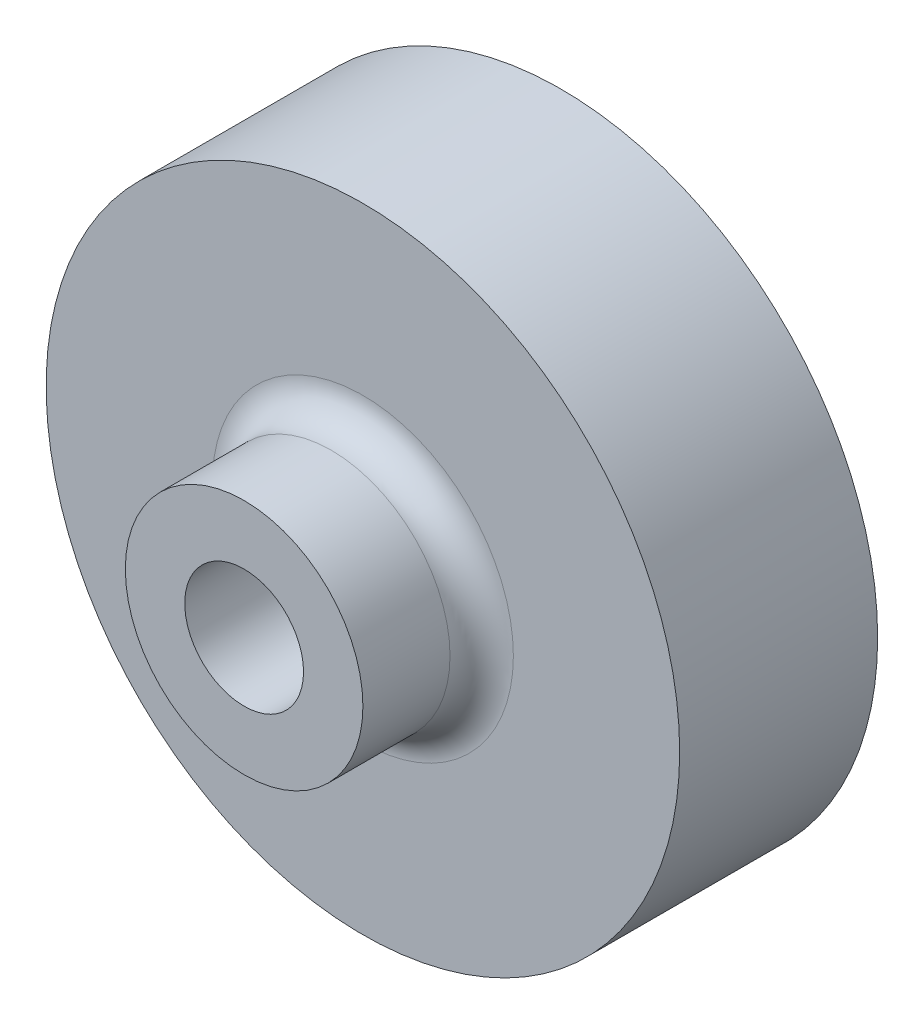
ISO-10303-21;
HEADER;
FILE_DESCRIPTION(('STEP AP214'),'2;1');
FILE_NAME('part.step','',(''),(''),'','','');
FILE_SCHEMA(('AUTOMOTIVE_DESIGN { 1 0 10303 214 1 1 1 1 }'));
ENDSEC;
DATA;
#1=APPLICATION_CONTEXT('core data for automotive mechanical design processes');
#2=APPLICATION_PROTOCOL_DEFINITION('international standard','automotive_design',2000,#1);
#3=PRODUCT_CONTEXT('',#1,'mechanical');
#4=PRODUCT('Part','Part','',(#3));
#5=PRODUCT_RELATED_PRODUCT_CATEGORY('part','',(#4));
#6=PRODUCT_DEFINITION_FORMATION('','',#4);
#7=PRODUCT_DEFINITION_CONTEXT('part definition',#1,'design');
#8=PRODUCT_DEFINITION('design','',#6,#7);
#9=PRODUCT_DEFINITION_SHAPE('','',#8);
#10=(LENGTH_UNIT() NAMED_UNIT(*) SI_UNIT(.MILLI.,.METRE.));
#11=(NAMED_UNIT(*) PLANE_ANGLE_UNIT() SI_UNIT($,.RADIAN.));
#12=(NAMED_UNIT(*) SI_UNIT($,.STERADIAN.) SOLID_ANGLE_UNIT());
#13=UNCERTAINTY_MEASURE_WITH_UNIT(LENGTH_MEASURE(1.E-05),#10,'distance_accuracy_value','');
#14=(GEOMETRIC_REPRESENTATION_CONTEXT(3) GLOBAL_UNCERTAINTY_ASSIGNED_CONTEXT((#13)) GLOBAL_UNIT_ASSIGNED_CONTEXT((#10,
#11,#12)) REPRESENTATION_CONTEXT('',''));
#15=CARTESIAN_POINT('',(0.,0.,0.));
#16=DIRECTION('',(0.,0.,1.));
#17=DIRECTION('',(1.,0.,0.));
#18=AXIS2_PLACEMENT_3D('',#15,#16,#17);
#19=CARTESIAN_POINT('',(0.,0.,6.25));
#20=DIRECTION('',(0.,0.,1.));
#21=DIRECTION('',(1.,0.,0.));
#22=AXIS2_PLACEMENT_3D('',#19,#20,#21);
#23=PLANE('',#22);
#24=CARTESIAN_POINT('',(0.,0.,6.25));
#25=DIRECTION('',(0.,0.,1.));
#26=DIRECTION('',(1.,0.,0.));
#27=AXIS2_PLACEMENT_3D('',#24,#25,#26);
#28=CIRCLE('',#27,4.75);
#29=CARTESIAN_POINT('',(4.75,0.,6.25));
#30=VERTEX_POINT('',#29);
#31=EDGE_CURVE('E12',#30,#30,#28,.F.);
#32=ORIENTED_EDGE('',*,*,#31,.T.);
#33=EDGE_LOOP('',(#32));
#34=FACE_BOUND('',#33,.T.);
#35=CARTESIAN_POINT('',(0.,0.,6.25));
#36=DIRECTION('',(0.,0.,1.));
#37=DIRECTION('',(1.,0.,0.));
#38=AXIS2_PLACEMENT_3D('',#35,#36,#37);
#39=CIRCLE('',#38,10.);
#40=CARTESIAN_POINT('',(10.,0.,6.25));
#41=VERTEX_POINT('',#40);
#42=EDGE_CURVE('E111',#41,#41,#39,.T.);
#43=ORIENTED_EDGE('',*,*,#42,.T.);
#44=EDGE_LOOP('',(#43));
#45=FACE_BOUND('',#44,.T.);
#46=ADVANCED_FACE('F57',(#34,#45),#23,.T.);
#47=CARTESIAN_POINT('',(0.,0.,1.25));
#48=DIRECTION('',(0.,0.,1.));
#49=DIRECTION('',(1.,0.,0.));
#50=AXIS2_PLACEMENT_3D('',#47,#48,#49);
#51=PLANE('',#50);
#52=DIRECTION('',(0.,-1.,0.));
#53=VECTOR('',#52,1.);
#54=CARTESIAN_POINT('',(0.5,0.,1.25));
#55=LINE('',#54,#53);
#56=CARTESIAN_POINT('',(0.5,1.80710403685012,1.25));
#57=VERTEX_POINT('',#56);
#58=CARTESIAN_POINT('',(0.5,-1.80710403685012,1.25));
#59=VERTEX_POINT('',#58);
#60=EDGE_CURVE('E107',#57,#59,#55,.T.);
#61=ORIENTED_EDGE('',*,*,#60,.F.);
#62=CARTESIAN_POINT('',(0.,0.,1.25));
#63=DIRECTION('',(0.,0.,1.));
#64=DIRECTION('',(1.,0.,0.));
#65=AXIS2_PLACEMENT_3D('',#62,#63,#64);
#66=CIRCLE('',#65,1.875);
#67=CARTESIAN_POINT('',(-0.5,1.80710403685012,1.25));
#68=VERTEX_POINT('',#67);
#69=EDGE_CURVE('E102',#57,#68,#66,.T.);
#70=ORIENTED_EDGE('',*,*,#69,.T.);
#71=DIRECTION('',(0.,-1.,0.));
#72=VECTOR('',#71,1.);
#73=CARTESIAN_POINT('',(-0.5,0.,1.25));
#74=LINE('',#73,#72);
#75=CARTESIAN_POINT('',(-0.5,-1.80710403685012,1.25));
#76=VERTEX_POINT('',#75);
#77=EDGE_CURVE('E105',#68,#76,#74,.T.);
#78=ORIENTED_EDGE('',*,*,#77,.T.);
#79=EDGE_CURVE('E114',#76,#59,#66,.T.);
#80=ORIENTED_EDGE('',*,*,#79,.T.);
#81=EDGE_LOOP('',(#61,#70,#78,#80));
#82=FACE_BOUND('',#81,.T.);
#83=ADVANCED_FACE('F104',(#82),#51,.T.);
#84=CARTESIAN_POINT('',(0.,0.,0.));
#85=DIRECTION('',(0.,0.,1.));
#86=DIRECTION('',(1.,0.,0.));
#87=AXIS2_PLACEMENT_3D('',#84,#85,#86);
#88=PLANE('',#87);
#89=CARTESIAN_POINT('',(0.,0.,0.));
#90=DIRECTION('',(0.,0.,1.));
#91=DIRECTION('',(1.,0.,0.));
#92=AXIS2_PLACEMENT_3D('',#89,#90,#91);
#93=CIRCLE('',#92,10.);
#94=CARTESIAN_POINT('',(10.,0.,0.));
#95=VERTEX_POINT('',#94);
#96=EDGE_CURVE('E126',#95,#95,#93,.T.);
#97=ORIENTED_EDGE('',*,*,#96,.F.);
#98=EDGE_LOOP('',(#97));
#99=FACE_BOUND('',#98,.T.);
#100=CARTESIAN_POINT('',(0.,0.,0.));
#101=DIRECTION('',(0.,0.,1.));
#102=DIRECTION('',(1.,0.,0.));
#103=AXIS2_PLACEMENT_3D('',#100,#101,#102);
#104=CIRCLE('',#103,1.875);
#105=CARTESIAN_POINT('',(-0.5,1.80710403685012,0.));
#106=VERTEX_POINT('',#105);
#107=CARTESIAN_POINT('',(-0.5,-1.80710403685012,0.));
#108=VERTEX_POINT('',#107);
#109=EDGE_CURVE('E120',#106,#108,#104,.T.);
#110=ORIENTED_EDGE('',*,*,#109,.T.);
#111=DIRECTION('',(0.,-1.,0.));
#112=VECTOR('',#111,1.);
#113=CARTESIAN_POINT('',(-0.5,0.,0.));
#114=LINE('',#113,#112);
#115=EDGE_CURVE('E81',#106,#108,#114,.T.);
#116=ORIENTED_EDGE('',*,*,#115,.F.);
#117=EDGE_LOOP('',(#110,#116));
#118=FACE_BOUND('',#117,.T.);
#119=DIRECTION('',(0.,-1.,0.));
#120=VECTOR('',#119,1.);
#121=CARTESIAN_POINT('',(0.5,0.,0.));
#122=LINE('',#121,#120);
#123=CARTESIAN_POINT('',(0.5,1.80710403685012,0.));
#124=VERTEX_POINT('',#123);
#125=CARTESIAN_POINT('',(0.5,-1.80710403685012,0.));
#126=VERTEX_POINT('',#125);
#127=EDGE_CURVE('E73',#124,#126,#122,.T.);
#128=ORIENTED_EDGE('',*,*,#127,.T.);
#129=CARTESIAN_POINT('',(0.,0.,0.));
#130=DIRECTION('',(0.,0.,1.));
#131=DIRECTION('',(1.,0.,0.));
#132=AXIS2_PLACEMENT_3D('',#129,#130,#131);
#133=CIRCLE('',#132,1.875);
#134=EDGE_CURVE('E149',#126,#124,#133,.T.);
#135=ORIENTED_EDGE('',*,*,#134,.T.);
#136=EDGE_LOOP('',(#128,#135));
#137=FACE_BOUND('',#136,.T.);
#138=ADVANCED_FACE('F163',(#99,#118,#137),#88,.F.);
#139=CARTESIAN_POINT('',(0.,0.,1.25));
#140=DIRECTION('',(0.,0.,-1.));
#141=DIRECTION('',(-1.,0.,0.));
#142=AXIS2_PLACEMENT_3D('',#139,#140,#141);
#143=CYLINDRICAL_SURFACE('',#142,10.);
#144=ORIENTED_EDGE('',*,*,#96,.T.);
#145=EDGE_LOOP('',(#144));
#146=FACE_BOUND('',#145,.T.);
#147=ORIENTED_EDGE('',*,*,#42,.F.);
#148=EDGE_LOOP('',(#147));
#149=FACE_BOUND('',#148,.T.);
#150=ADVANCED_FACE('F166',(#146,#149),#143,.T.);
#151=CARTESIAN_POINT('',(-0.5,0.,1.25));
#152=DIRECTION('',(1.,0.,0.));
#153=DIRECTION('',(0.,0.,-1.));
#154=AXIS2_PLACEMENT_3D('',#151,#152,#153);
#155=PLANE('',#154);
#156=ORIENTED_EDGE('',*,*,#115,.T.);
#157=DIRECTION('',(0.,0.,-1.));
#158=VECTOR('',#157,1.);
#159=CARTESIAN_POINT('',(-0.5,-1.80710403685012,1.25));
#160=LINE('',#159,#158);
#161=EDGE_CURVE('E118',#76,#108,#160,.T.);
#162=ORIENTED_EDGE('',*,*,#161,.F.);
#163=ORIENTED_EDGE('',*,*,#77,.F.);
#164=DIRECTION('',(0.,0.,-1.));
#165=VECTOR('',#164,1.);
#166=CARTESIAN_POINT('',(-0.5,1.80710403685012,1.25));
#167=LINE('',#166,#165);
#168=EDGE_CURVE('E116',#68,#106,#167,.T.);
#169=ORIENTED_EDGE('',*,*,#168,.T.);
#170=EDGE_LOOP('',(#156,#162,#163,#169));
#171=FACE_BOUND('',#170,.T.);
#172=ADVANCED_FACE('F115',(#171),#155,.F.);
#173=CARTESIAN_POINT('',(0.,0.,1.25));
#174=DIRECTION('',(0.,0.,-1.));
#175=DIRECTION('',(-1.,0.,0.));
#176=AXIS2_PLACEMENT_3D('',#173,#174,#175);
#177=CYLINDRICAL_SURFACE('',#176,1.875);
#178=ORIENTED_EDGE('',*,*,#109,.F.);
#179=ORIENTED_EDGE('',*,*,#168,.F.);
#180=ORIENTED_EDGE('',*,*,#69,.F.);
#181=DIRECTION('',(0.,0.,-1.));
#182=VECTOR('',#181,1.);
#183=CARTESIAN_POINT('',(0.5,1.80710403685012,1.25));
#184=LINE('',#183,#182);
#185=EDGE_CURVE('E148',#57,#124,#184,.T.);
#186=ORIENTED_EDGE('',*,*,#185,.T.);
#187=ORIENTED_EDGE('',*,*,#134,.F.);
#188=DIRECTION('',(0.,0.,-1.));
#189=VECTOR('',#188,1.);
#190=CARTESIAN_POINT('',(0.5,-1.80710403685012,1.25));
#191=LINE('',#190,#189);
#192=EDGE_CURVE('E157',#59,#126,#191,.T.);
#193=ORIENTED_EDGE('',*,*,#192,.F.);
#194=ORIENTED_EDGE('',*,*,#79,.F.);
#195=ORIENTED_EDGE('',*,*,#161,.T.);
#196=EDGE_LOOP('',(#178,#179,#180,#186,#187,#193,#194,#195));
#197=FACE_BOUND('',#196,.T.);
#198=CARTESIAN_POINT('',(0.,0.,10.));
#199=DIRECTION('',(0.,0.,1.));
#200=DIRECTION('',(1.,0.,0.));
#201=AXIS2_PLACEMENT_3D('',#198,#199,#200);
#202=CIRCLE('',#201,1.875);
#203=CARTESIAN_POINT('',(1.875,0.,10.));
#204=VERTEX_POINT('',#203);
#205=EDGE_CURVE('E199',#204,#204,#202,.T.);
#206=ORIENTED_EDGE('',*,*,#205,.T.);
#207=EDGE_LOOP('',(#206));
#208=FACE_BOUND('',#207,.T.);
#209=ADVANCED_FACE('F122',(#197,#208),#177,.F.);
#210=CARTESIAN_POINT('',(0.5,0.,1.25));
#211=DIRECTION('',(1.,0.,0.));
#212=DIRECTION('',(0.,0.,-1.));
#213=AXIS2_PLACEMENT_3D('',#210,#211,#212);
#214=PLANE('',#213);
#215=ORIENTED_EDGE('',*,*,#127,.F.);
#216=ORIENTED_EDGE('',*,*,#185,.F.);
#217=ORIENTED_EDGE('',*,*,#60,.T.);
#218=ORIENTED_EDGE('',*,*,#192,.T.);
#219=EDGE_LOOP('',(#215,#216,#217,#218));
#220=FACE_BOUND('',#219,.T.);
#221=ADVANCED_FACE('F169',(#220),#214,.T.);
#222=CARTESIAN_POINT('',(0.,0.,10.));
#223=DIRECTION('',(0.,0.,1.));
#224=DIRECTION('',(1.,0.,0.));
#225=AXIS2_PLACEMENT_3D('',#222,#223,#224);
#226=PLANE('',#225);
#227=CARTESIAN_POINT('',(0.,0.,10.));
#228=DIRECTION('',(0.,0.,1.));
#229=DIRECTION('',(1.,0.,0.));
#230=AXIS2_PLACEMENT_3D('',#227,#228,#229);
#231=CIRCLE('',#230,3.75);
#232=CARTESIAN_POINT('',(3.75,0.,10.));
#233=VERTEX_POINT('',#232);
#234=EDGE_CURVE('E112',#233,#233,#231,.T.);
#235=ORIENTED_EDGE('',*,*,#234,.T.);
#236=EDGE_LOOP('',(#235));
#237=FACE_BOUND('',#236,.T.);
#238=ORIENTED_EDGE('',*,*,#205,.F.);
#239=EDGE_LOOP('',(#238));
#240=FACE_BOUND('',#239,.T.);
#241=ADVANCED_FACE('F171',(#237,#240),#226,.T.);
#242=CARTESIAN_POINT('',(0.,0.,10.));
#243=DIRECTION('',(0.,0.,-1.));
#244=DIRECTION('',(-1.,0.,0.));
#245=AXIS2_PLACEMENT_3D('',#242,#243,#244);
#246=CYLINDRICAL_SURFACE('',#245,3.75);
#247=CARTESIAN_POINT('',(0.,0.,7.25));
#248=DIRECTION('',(0.,0.,1.));
#249=DIRECTION('',(1.,0.,0.));
#250=AXIS2_PLACEMENT_3D('',#247,#248,#249);
#251=CIRCLE('',#250,3.75);
#252=CARTESIAN_POINT('',(3.75,0.,7.25));
#253=VERTEX_POINT('',#252);
#254=EDGE_CURVE('E66',#253,#253,#251,.T.);
#255=ORIENTED_EDGE('',*,*,#254,.T.);
#256=EDGE_LOOP('',(#255));
#257=FACE_BOUND('',#256,.T.);
#258=ORIENTED_EDGE('',*,*,#234,.F.);
#259=EDGE_LOOP('',(#258));
#260=FACE_BOUND('',#259,.T.);
#261=ADVANCED_FACE('F177',(#257,#260),#246,.T.);
#262=CARTESIAN_POINT('',(0.,0.,7.25));
#263=DIRECTION('',(0.,0.,1.));
#264=DIRECTION('',(1.,0.,0.));
#265=AXIS2_PLACEMENT_3D('',#262,#263,#264);
#266=TOROIDAL_SURFACE('',#265,4.75,1.);
#267=ORIENTED_EDGE('',*,*,#31,.F.);
#268=EDGE_LOOP('',(#267));
#269=FACE_BOUND('',#268,.T.);
#270=ORIENTED_EDGE('',*,*,#254,.F.);
#271=EDGE_LOOP('',(#270));
#272=FACE_BOUND('',#271,.T.);
#273=ADVANCED_FACE('F59',(#269,#272),#266,.F.);
#274=CLOSED_SHELL('',(#46,#83,#138,#150,#172,#209,#221,#241,#261,#273));
#275=MANIFOLD_SOLID_BREP('B2',#274);
#276=ADVANCED_BREP_SHAPE_REPRESENTATION('',(#18,#275),#14);
#277=SHAPE_DEFINITION_REPRESENTATION(#9,#276);
ENDSEC;
END-ISO-10303-21;
